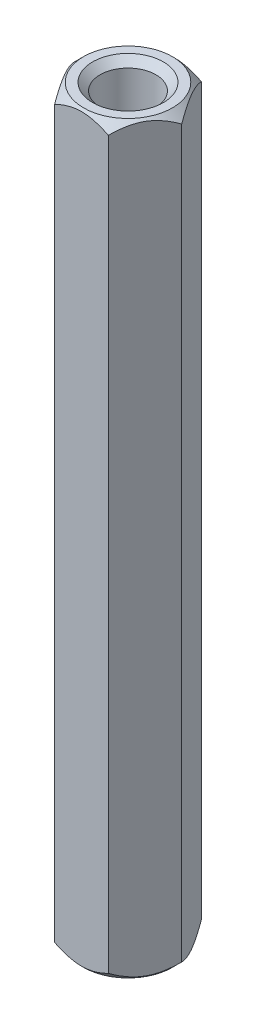
ISO-10303-21;
HEADER;
FILE_DESCRIPTION(('STEP AP214'),'2;1');
FILE_NAME('part.step','',(''),(''),'','','');
FILE_SCHEMA(('AUTOMOTIVE_DESIGN { 1 0 10303 214 1 1 1 1 }'));
ENDSEC;
DATA;
#1=APPLICATION_CONTEXT('core data for automotive mechanical design processes');
#2=APPLICATION_PROTOCOL_DEFINITION('international standard','automotive_design',2000,#1);
#3=PRODUCT_CONTEXT('',#1,'mechanical');
#4=PRODUCT('Part','Part','',(#3));
#5=PRODUCT_RELATED_PRODUCT_CATEGORY('part','',(#4));
#6=PRODUCT_DEFINITION_FORMATION('','',#4);
#7=PRODUCT_DEFINITION_CONTEXT('part definition',#1,'design');
#8=PRODUCT_DEFINITION('design','',#6,#7);
#9=PRODUCT_DEFINITION_SHAPE('','',#8);
#10=(LENGTH_UNIT() NAMED_UNIT(*) SI_UNIT(.MILLI.,.METRE.));
#11=(NAMED_UNIT(*) PLANE_ANGLE_UNIT() SI_UNIT($,.RADIAN.));
#12=(NAMED_UNIT(*) SI_UNIT($,.STERADIAN.) SOLID_ANGLE_UNIT());
#13=UNCERTAINTY_MEASURE_WITH_UNIT(LENGTH_MEASURE(1.E-05),#10,'distance_accuracy_value','');
#14=(GEOMETRIC_REPRESENTATION_CONTEXT(3) GLOBAL_UNCERTAINTY_ASSIGNED_CONTEXT((#13)) GLOBAL_UNIT_ASSIGNED_CONTEXT((#10,
#11,#12)) REPRESENTATION_CONTEXT('',''));
#15=CARTESIAN_POINT('',(0.,0.,0.));
#16=DIRECTION('',(0.,0.,1.));
#17=DIRECTION('',(1.,0.,0.));
#18=AXIS2_PLACEMENT_3D('',#15,#16,#17);
#19=CARTESIAN_POINT('',(0.,0.,0.));
#20=DIRECTION('',(0.,1.,0.));
#21=DIRECTION('',(0.,0.,1.));
#22=AXIS2_PLACEMENT_3D('',#19,#20,#21);
#23=PLANE('',#22);
#24=CARTESIAN_POINT('',(0.,0.,0.));
#25=DIRECTION('',(0.,1.,0.));
#26=DIRECTION('',(0.,0.,1.));
#27=AXIS2_PLACEMENT_3D('',#24,#25,#26);
#28=CIRCLE('',#27,2.413);
#29=CARTESIAN_POINT('',(0.,0.,2.413));
#30=VERTEX_POINT('',#29);
#31=EDGE_CURVE('E270',#30,#30,#28,.T.);
#32=ORIENTED_EDGE('',*,*,#31,.T.);
#33=EDGE_LOOP('',(#32));
#34=FACE_BOUND('',#33,.T.);
#35=CARTESIAN_POINT('',(0.,0.,0.));
#36=DIRECTION('',(0.,1.,0.));
#37=DIRECTION('',(0.,0.,1.));
#38=AXIS2_PLACEMENT_3D('',#35,#36,#37);
#39=CIRCLE('',#38,3.03117420935412);
#40=CARTESIAN_POINT('',(0.,0.,3.03117420935412));
#41=VERTEX_POINT('',#40);
#42=EDGE_CURVE('E273',#41,#41,#39,.T.);
#43=ORIENTED_EDGE('',*,*,#42,.F.);
#44=EDGE_LOOP('',(#43));
#45=FACE_BOUND('',#44,.T.);
#46=ADVANCED_FACE('F47',(#34,#45),#23,.F.);
#47=CARTESIAN_POINT('',(0.,50.8,0.));
#48=DIRECTION('',(0.,1.,0.));
#49=DIRECTION('',(0.,0.,1.));
#50=AXIS2_PLACEMENT_3D('',#47,#48,#49);
#51=PLANE('',#50);
#52=CARTESIAN_POINT('',(0.,50.8,0.));
#53=DIRECTION('',(0.,1.,0.));
#54=DIRECTION('',(0.,0.,1.));
#55=AXIS2_PLACEMENT_3D('',#52,#53,#54);
#56=CIRCLE('',#55,2.41300000000001);
#57=CARTESIAN_POINT('',(0.,50.8,2.41300000000001));
#58=VERTEX_POINT('',#57);
#59=EDGE_CURVE('E11',#58,#58,#56,.F.);
#60=ORIENTED_EDGE('',*,*,#59,.T.);
#61=EDGE_LOOP('',(#60));
#62=FACE_BOUND('',#61,.T.);
#63=CARTESIAN_POINT('',(0.,50.8,0.));
#64=DIRECTION('',(0.,1.,0.));
#65=DIRECTION('',(0.,0.,1.));
#66=AXIS2_PLACEMENT_3D('',#63,#64,#65);
#67=CIRCLE('',#66,3.03117420935412);
#68=CARTESIAN_POINT('',(0.,50.8,3.03117420935412));
#69=VERTEX_POINT('',#68);
#70=EDGE_CURVE('E276',#69,#69,#67,.T.);
#71=ORIENTED_EDGE('',*,*,#70,.T.);
#72=EDGE_LOOP('',(#71));
#73=FACE_BOUND('',#72,.T.);
#74=ADVANCED_FACE('F260',(#62,#73),#51,.T.);
#75=CARTESIAN_POINT('',(0.,50.8,0.));
#76=DIRECTION('',(0.,-1.,0.));
#77=DIRECTION('',(0.,0.,-1.));
#78=AXIS2_PLACEMENT_3D('',#75,#76,#77);
#79=CYLINDRICAL_SURFACE('',#78,1.905);
#80=CARTESIAN_POINT('',(0.,0.508000000000002,0.));
#81=DIRECTION('',(0.,1.,0.));
#82=DIRECTION('',(0.,0.,1.));
#83=AXIS2_PLACEMENT_3D('',#80,#81,#82);
#84=CIRCLE('',#83,1.905);
#85=CARTESIAN_POINT('',(0.,0.508000000000002,1.905));
#86=VERTEX_POINT('',#85);
#87=EDGE_CURVE('E57',#86,#86,#84,.F.);
#88=ORIENTED_EDGE('',*,*,#87,.T.);
#89=EDGE_LOOP('',(#88));
#90=FACE_BOUND('',#89,.T.);
#91=CARTESIAN_POINT('',(0.,50.292,0.));
#92=DIRECTION('',(0.,1.,0.));
#93=DIRECTION('',(0.,0.,1.));
#94=AXIS2_PLACEMENT_3D('',#91,#92,#93);
#95=CIRCLE('',#94,1.905);
#96=CARTESIAN_POINT('',(0.,50.292,1.905));
#97=VERTEX_POINT('',#96);
#98=EDGE_CURVE('E295',#97,#97,#95,.T.);
#99=ORIENTED_EDGE('',*,*,#98,.T.);
#100=EDGE_LOOP('',(#99));
#101=FACE_BOUND('',#100,.T.);
#102=ADVANCED_FACE('F171',(#90,#101),#79,.F.);
#103=CARTESIAN_POINT('',(0.,50.8,0.));
#104=DIRECTION('',(0.,-1.,0.));
#105=DIRECTION('',(0.,0.,-1.));
#106=AXIS2_PLACEMENT_3D('',#103,#104,#105);
#107=CONICAL_SURFACE('',#106,3.03117420935412,0.785398163397455);
#108=ORIENTED_EDGE('',*,*,#70,.F.);
#109=EDGE_LOOP('',(#108));
#110=FACE_BOUND('',#109,.T.);
#111=CARTESIAN_POINT('',(1.83297163462323,50.1648845244911,3.1752));
#112=CARTESIAN_POINT('',(1.89598269034567,50.2278410163082,3.06606165005017));
#113=CARTESIAN_POINT('',(1.9600473688431,50.2870998957653,2.95509837192205));
#114=CARTESIAN_POINT('',(2.09068223086865,50.3956013442695,2.72883215365405));
#115=CARTESIAN_POINT('',(2.15726483710766,50.4447835460613,2.61350769674773));
#116=CARTESIAN_POINT('',(2.29152545937819,50.529033541126,2.38096147751937));
#117=CARTESIAN_POINT('',(2.35916928558036,50.5643130855006,2.26379893371884));
#118=CARTESIAN_POINT('',(2.49594609220167,50.6186684298652,2.02689455535371));
#119=CARTESIAN_POINT('',(2.56507489458671,50.6377848024704,1.90715995735643));
#120=CARTESIAN_POINT('',(2.68421566990708,50.6550328693768,1.7008020812484));
#121=CARTESIAN_POINT('',(2.73407378526964,50.6575860663862,1.61444529227083));
#122=CARTESIAN_POINT('',(2.83370891608765,50.6532837268767,1.44187218347526));
#123=CARTESIAN_POINT('',(2.88348589698875,50.6464248919786,1.35565592350718));
#124=CARTESIAN_POINT('',(2.98256827629563,50.6236901166963,1.18404020841285));
#125=CARTESIAN_POINT('',(3.0318730843838,50.6078040903127,1.0986417757467));
#126=CARTESIAN_POINT('',(3.12963590884151,50.567882016002,0.9293115966945));
#127=CARTESIAN_POINT('',(3.17809398983285,50.5438465929148,0.845379738380225));
#128=CARTESIAN_POINT('',(3.26412109539651,50.4943947655828,0.696376420715858));
#129=CARTESIAN_POINT('',(3.30188053733772,50.470278280699,0.630975148808243));
#130=CARTESIAN_POINT('',(3.37672152840271,50.4181585328628,0.501346749794873));
#131=CARTESIAN_POINT('',(3.41380305681744,50.3901551513965,0.43711965855826));
#132=CARTESIAN_POINT('',(3.4871713971199,50.3308894344555,0.310041965487388));
#133=CARTESIAN_POINT('',(3.52346029578353,50.2996373466458,0.247187749251266));
#134=CARTESIAN_POINT('',(3.59536602138645,50.2342846556081,0.1226433791519));
#135=CARTESIAN_POINT('',(3.63098324454239,50.2001858004815,0.0609525390212849));
#136=CARTESIAN_POINT('',(3.66628967940796,50.1648845244911,-0.000200000000001985));
#137=B_SPLINE_CURVE_WITH_KNOTS('',3,(#111,#112,#113,#114,#115,#116,#117,#118,#119,#120,#121,
#122,#123,#124,#125,#126,#127,#128,#129,#130,#131,#132,#133,#134,#135,#136),.UNSPECIFIED.,.F.,
.F.,(4,2,2,2,2,2,2,2,2,2,2,2,4),(0.,0.422910572436811,0.848285055427816,1.26690402276128,
1.68446903107508,1.98329272958354,2.28222117546893,2.58148426995468,2.88072442418455,
3.11844134429548,3.35616551414407,3.59316134346767,3.8300126974443),.UNSPECIFIED.);
#138=CARTESIAN_POINT('',(1.83308710467706,50.165,3.175));
#139=VERTEX_POINT('',#138);
#140=CARTESIAN_POINT('',(3.66617420935412,50.165,0.));
#141=VERTEX_POINT('',#140);
#142=EDGE_CURVE('E102',#139,#141,#137,.T.);
#143=ORIENTED_EDGE('',*,*,#142,.T.);
#144=CARTESIAN_POINT('',(3.66628967940796,50.1648845244911,0.000199999999999294));
#145=CARTESIAN_POINT('',(3.60327862368552,50.2278410163082,-0.108938349949828));
#146=CARTESIAN_POINT('',(3.53921394518808,50.2870998957653,-0.219901628077947));
#147=CARTESIAN_POINT('',(3.40857908316253,50.3956013442695,-0.44616784634595));
#148=CARTESIAN_POINT('',(3.34199647692352,50.4447835460613,-0.561492303252267));
#149=CARTESIAN_POINT('',(3.207735854653,50.529033541126,-0.794038522480632));
#150=CARTESIAN_POINT('',(3.14009202845082,50.5643130855006,-0.911201066281157));
#151=CARTESIAN_POINT('',(3.00331522182951,50.6186684298652,-1.14810544464629));
#152=CARTESIAN_POINT('',(2.93418641944448,50.6377848024704,-1.26784004264356));
#153=CARTESIAN_POINT('',(2.81504564412411,50.6550328693768,-1.47419791875159));
#154=CARTESIAN_POINT('',(2.76518752876155,50.6575860663862,-1.56055470772917));
#155=CARTESIAN_POINT('',(2.66555239794354,50.6532837268767,-1.73312781652473));
#156=CARTESIAN_POINT('',(2.61577541704244,50.6464248919786,-1.81934407649282));
#157=CARTESIAN_POINT('',(2.51669303773556,50.6236901166963,-1.99095979158715));
#158=CARTESIAN_POINT('',(2.46738822964739,50.6078040903127,-2.07635822425329));
#159=CARTESIAN_POINT('',(2.36962540518967,50.567882016002,-2.2456884033055));
#160=CARTESIAN_POINT('',(2.32116732419834,50.5438465929148,-2.32962026161977));
#161=CARTESIAN_POINT('',(2.23514021863467,50.4943947655828,-2.47862357928414));
#162=CARTESIAN_POINT('',(2.19738077669347,50.470278280699,-2.54402485119175));
#163=CARTESIAN_POINT('',(2.12253978562848,50.4181585328628,-2.67365325020513));
#164=CARTESIAN_POINT('',(2.08545825721375,50.3901551513965,-2.73788034144174));
#165=CARTESIAN_POINT('',(2.01208991691129,50.3308894344555,-2.86495803451261));
#166=CARTESIAN_POINT('',(1.97580101824766,50.2996373466458,-2.92781225074873));
#167=CARTESIAN_POINT('',(1.90389529264474,50.2342846556081,-3.0523566208481));
#168=CARTESIAN_POINT('',(1.86827806948879,50.2001858004815,-3.11404746097871));
#169=CARTESIAN_POINT('',(1.83297163462322,50.1648845244911,-3.1752));
#170=B_SPLINE_CURVE_WITH_KNOTS('',3,(#144,#145,#146,#147,#148,#149,#150,#151,#152,#153,#154,
#155,#156,#157,#158,#159,#160,#161,#162,#163,#164,#165,#166,#167,#168,#169),.UNSPECIFIED.,.F.,
.F.,(4,2,2,2,2,2,2,2,2,2,2,2,4),(0.,0.42291057243681,0.848285055427814,1.26690402276128,
1.68446903107507,1.98329272958353,2.28222117546892,2.58148426995468,2.88072442418455,
3.11844134429548,3.35616551414406,3.59316134346767,3.8300126974443),.UNSPECIFIED.);
#171=CARTESIAN_POINT('',(1.83308710467706,50.165,-3.175));
#172=VERTEX_POINT('',#171);
#173=EDGE_CURVE('E120',#141,#172,#170,.T.);
#174=ORIENTED_EDGE('',*,*,#173,.T.);
#175=CARTESIAN_POINT('',(5.61290617506479,47.3825045225055,-3.175));
#176=CARTESIAN_POINT('',(5.44732323893505,47.5265718843868,-3.175));
#177=CARTESIAN_POINT('',(5.28101909971827,47.6698274026015,-3.175));
#178=CARTESIAN_POINT('',(4.94640706370483,47.9541346726965,-3.175));
#179=CARTESIAN_POINT('',(4.77809827268191,48.095185370824,-3.175));
#180=CARTESIAN_POINT('',(4.43534717886911,48.3774323105833,-3.175));
#181=CARTESIAN_POINT('',(4.26085133978467,48.5185637753496,-3.175));
#182=CARTESIAN_POINT('',(3.90862720541281,48.7966652521518,-3.175));
#183=CARTESIAN_POINT('',(3.73089972486959,48.9336362904604,-3.175));
#184=CARTESIAN_POINT('',(3.37091941799771,49.2019952183891,-3.175));
#185=CARTESIAN_POINT('',(3.18866131314985,49.3333760606888,-3.175));
#186=CARTESIAN_POINT('',(2.81821451137681,49.5879737307244,-3.175));
#187=CARTESIAN_POINT('',(2.63002118112734,49.711183935003,-3.175));
#188=CARTESIAN_POINT('',(2.34265967138502,49.8861750005027,-3.175));
#189=CARTESIAN_POINT('',(2.24637591489893,49.9426856213251,-3.175));
#190=CARTESIAN_POINT('',(2.0516194430317,50.051855803702,-3.175));
#191=CARTESIAN_POINT('',(1.95314646520395,50.1045149002493,-3.175));
#192=CARTESIAN_POINT('',(1.75391284586501,50.2049572984449,-3.175));
#193=CARTESIAN_POINT('',(1.65315588807968,50.2527478512795,-3.175));
#194=CARTESIAN_POINT('',(1.44902458223588,50.3423504891832,-3.175));
#195=CARTESIAN_POINT('',(1.34565094994104,50.3841641887937,-3.175));
#196=CARTESIAN_POINT('',(1.13381810325428,50.4612742055481,-3.175));
#197=CARTESIAN_POINT('',(1.02529677325664,50.4964022639523,-3.175));
#198=CARTESIAN_POINT('',(0.805623275609342,50.5572573121023,-3.175));
#199=CARTESIAN_POINT('',(0.69447152908934,50.5829857960223,-3.175));
#200=CARTESIAN_POINT('',(0.470887391316211,50.6233142444286,-3.175));
#201=CARTESIAN_POINT('',(0.358468357961218,50.6379867869456,-3.175));
#202=CARTESIAN_POINT('',(0.132702878699556,50.655393961851,-3.175));
#203=CARTESIAN_POINT('',(0.0193565519572753,50.6581301047463,-3.175));
#204=CARTESIAN_POINT('',(-0.207220417890732,50.6514399649393,-3.175));
#205=CARTESIAN_POINT('',(-0.320450245169739,50.6419866604378,-3.175));
#206=CARTESIAN_POINT('',(-0.545349592106199,50.6116092001877,-3.175));
#207=CARTESIAN_POINT('',(-0.657018784259608,50.5906826727426,-3.175));
#208=CARTESIAN_POINT('',(-0.878771128248322,50.5385845599097,-3.175));
#209=CARTESIAN_POINT('',(-0.988836381351385,50.5073381628379,-3.175));
#210=CARTESIAN_POINT('',(-1.20614787324581,50.4363455170065,-3.175));
#211=CARTESIAN_POINT('',(-1.31339403790103,50.3965990449632,-3.175));
#212=CARTESIAN_POINT('',(-1.54643707959043,50.3015015449478,-3.175));
#213=CARTESIAN_POINT('',(-1.67160382978464,50.2446202355638,-3.175));
#214=CARTESIAN_POINT('',(-1.91822606859857,50.1232522807231,-3.175));
#215=CARTESIAN_POINT('',(-2.03967939558908,50.0587613078601,-3.175));
#216=CARTESIAN_POINT('',(-2.27955054647384,49.9238574759861,-3.175));
#217=CARTESIAN_POINT('',(-2.39796167176233,49.8534328035283,-3.175));
#218=CARTESIAN_POINT('',(-2.63196890501255,49.7081316035234,-3.175));
#219=CARTESIAN_POINT('',(-2.74756555699748,49.6332559461148,-3.175));
#220=CARTESIAN_POINT('',(-2.97704040949025,49.4796121809063,-3.175));
#221=CARTESIAN_POINT('',(-3.09090589461549,49.4008251698366,-3.175));
#222=CARTESIAN_POINT('',(-3.31666410566459,49.2404671404988,-3.175));
#223=CARTESIAN_POINT('',(-3.42855668167324,49.1588959120376,-3.175));
#224=CARTESIAN_POINT('',(-3.76149892463042,48.9110698440516,-3.175));
#225=CARTESIAN_POINT('',(-3.98008836672613,48.74151424494,-3.175));
#226=CARTESIAN_POINT('',(-4.43857055661304,48.3758785774618,-3.175));
#227=CARTESIAN_POINT('',(-4.67786798975818,48.1790590041652,-3.175));
#228=CARTESIAN_POINT('',(-5.03232612724527,47.8813056165569,-3.175));
#229=CARTESIAN_POINT('',(-5.14905444076479,47.7822262163152,-3.175));
#230=CARTESIAN_POINT('',(-5.38161209807003,47.5830722412516,-3.175));
#231=CARTESIAN_POINT('',(-5.49744164585887,47.48299790477,-3.175));
#232=CARTESIAN_POINT('',(-5.61290617506479,47.3825045225055,-3.175));
#233=B_SPLINE_CURVE_WITH_KNOTS('',3,(#175,#176,#177,#178,#179,#180,#181,#182,#183,#184,#185,
#186,#187,#188,#189,#190,#191,#192,#193,#194,#195,#196,#197,#198,#199,#200,#201,#202,#203,#204,
#205,#206,#207,#208,#209,#210,#211,#212,#213,#214,#215,#216,#217,#218,#219,#220,#221,#222,#223,
#224,#225,#226,#227,#228,#229,#230,#231,#232),.UNSPECIFIED.,.F.,.F.,(4,2,2,2,2,2,2,2,2,2,2,2,2,
2,2,2,2,2,2,2,2,2,2,2,2,2,2,2,4),(0.,0.658465440924479,1.31723651212542,1.99046902096711,
2.66353408887634,3.33742393680572,4.0118535534173,4.34671274542173,4.68161229957307,
5.01600553029358,5.35030825919232,5.69215068400589,6.03393874523514,6.37346306796546,
6.71294442391085,7.05317964400231,7.39348522262328,7.73631400153946,8.0791517871342,
8.49126076517264,8.9036052380698,9.31679098002148,9.72989621083109,10.1452412451898,
10.5606177054787,11.3903708195066,12.3198013539585,12.7791226544808,13.2383364543487),.UNSPECIFIED.);
#234=CARTESIAN_POINT('',(-1.83308710467706,50.165,-3.175));
#235=VERTEX_POINT('',#234);
#236=EDGE_CURVE('E194',#172,#235,#233,.T.);
#237=ORIENTED_EDGE('',*,*,#236,.T.);
#238=CARTESIAN_POINT('',(-1.83297163462322,50.1648845244911,-3.1752));
#239=CARTESIAN_POINT('',(-1.89598269034567,50.2278410163082,-3.06606165005017));
#240=CARTESIAN_POINT('',(-1.9600473688431,50.2870998957653,-2.95509837192205));
#241=CARTESIAN_POINT('',(-2.09068223086865,50.3956013442695,-2.72883215365405));
#242=CARTESIAN_POINT('',(-2.15726483710766,50.4447835460613,-2.61350769674773));
#243=CARTESIAN_POINT('',(-2.29152545937819,50.529033541126,-2.38096147751937));
#244=CARTESIAN_POINT('',(-2.35916928558036,50.5643130855006,-2.26379893371885));
#245=CARTESIAN_POINT('',(-2.49594609220167,50.6186684298652,-2.02689455535371));
#246=CARTESIAN_POINT('',(-2.56507489458671,50.6377848024704,-1.90715995735644));
#247=CARTESIAN_POINT('',(-2.68421566990708,50.6550328693768,-1.70080208124841));
#248=CARTESIAN_POINT('',(-2.73407378526963,50.6575860663862,-1.61444529227083));
#249=CARTESIAN_POINT('',(-2.83370891608764,50.6532837268767,-1.44187218347527));
#250=CARTESIAN_POINT('',(-2.88348589698874,50.6464248919786,-1.35565592350718));
#251=CARTESIAN_POINT('',(-2.98256827629562,50.6236901166963,-1.18404020841285));
#252=CARTESIAN_POINT('',(-3.03187308438379,50.6078040903127,-1.09864177574671));
#253=CARTESIAN_POINT('',(-3.12963590884151,50.567882016002,-0.929311596694504));
#254=CARTESIAN_POINT('',(-3.17809398983284,50.5438465929148,-0.845379738380229));
#255=CARTESIAN_POINT('',(-3.26412109539651,50.4943947655828,-0.696376420715863));
#256=CARTESIAN_POINT('',(-3.30188053733772,50.470278280699,-0.630975148808249));
#257=CARTESIAN_POINT('',(-3.37672152840271,50.4181585328628,-0.501346749794878));
#258=CARTESIAN_POINT('',(-3.41380305681743,50.3901551513965,-0.437119658558264));
#259=CARTESIAN_POINT('',(-3.4871713971199,50.3308894344555,-0.310041965487391));
#260=CARTESIAN_POINT('',(-3.52346029578353,50.2996373466458,-0.247187749251268));
#261=CARTESIAN_POINT('',(-3.59536602138645,50.2342846556081,-0.122643379151903));
#262=CARTESIAN_POINT('',(-3.63098324454239,50.2001858004815,-0.0609525390212875));
#263=CARTESIAN_POINT('',(-3.66628967940796,50.1648845244911,0.00020000000000061));
#264=B_SPLINE_CURVE_WITH_KNOTS('',3,(#238,#239,#240,#241,#242,#243,#244,#245,#246,#247,#248,
#249,#250,#251,#252,#253,#254,#255,#256,#257,#258,#259,#260,#261,#262,#263),.UNSPECIFIED.,.F.,
.F.,(4,2,2,2,2,2,2,2,2,2,2,2,4),(0.,0.42291057243681,0.848285055427813,1.26690402276128,
1.68446903107507,1.98329272958353,2.28222117546892,2.58148426995468,2.88072442418454,
3.11844134429548,3.35616551414406,3.59316134346767,3.8300126974443),.UNSPECIFIED.);
#265=CARTESIAN_POINT('',(-3.66617420935412,50.165,0.));
#266=VERTEX_POINT('',#265);
#267=EDGE_CURVE('E187',#235,#266,#264,.T.);
#268=ORIENTED_EDGE('',*,*,#267,.T.);
#269=CARTESIAN_POINT('',(-3.66628967940796,50.1648845244911,-0.000199999999999957));
#270=CARTESIAN_POINT('',(-3.60327862368552,50.2278410163082,0.108938349949828));
#271=CARTESIAN_POINT('',(-3.53921394518808,50.2870998957653,0.219901628077948));
#272=CARTESIAN_POINT('',(-3.40857908316253,50.3956013442695,0.446167846345952));
#273=CARTESIAN_POINT('',(-3.34199647692352,50.4447835460613,0.56149230325227));
#274=CARTESIAN_POINT('',(-3.207735854653,50.529033541126,0.794038522480636));
#275=CARTESIAN_POINT('',(-3.14009202845082,50.5643130855006,0.911201066281161));
#276=CARTESIAN_POINT('',(-3.00331522182951,50.6186684298652,1.14810544464629));
#277=CARTESIAN_POINT('',(-2.93418641944447,50.6377848024704,1.26784004264357));
#278=CARTESIAN_POINT('',(-2.8150456441241,50.6550328693768,1.47419791875159));
#279=CARTESIAN_POINT('',(-2.76518752876155,50.6575860663862,1.56055470772917));
#280=CARTESIAN_POINT('',(-2.66555239794354,50.6532837268767,1.73312781652473));
#281=CARTESIAN_POINT('',(-2.61577541704244,50.6464248919786,1.81934407649282));
#282=CARTESIAN_POINT('',(-2.51669303773556,50.6236901166963,1.99095979158715));
#283=CARTESIAN_POINT('',(-2.46738822964739,50.6078040903127,2.0763582242533));
#284=CARTESIAN_POINT('',(-2.36962540518967,50.567882016002,2.2456884033055));
#285=CARTESIAN_POINT('',(-2.32116732419834,50.5438465929148,2.32962026161977));
#286=CARTESIAN_POINT('',(-2.23514021863467,50.4943947655828,2.47862357928414));
#287=CARTESIAN_POINT('',(-2.19738077669347,50.470278280699,2.54402485119176));
#288=CARTESIAN_POINT('',(-2.12253978562848,50.4181585328628,2.67365325020513));
#289=CARTESIAN_POINT('',(-2.08545825721375,50.3901551513965,2.73788034144174));
#290=CARTESIAN_POINT('',(-2.01208991691129,50.3308894344555,2.86495803451261));
#291=CARTESIAN_POINT('',(-1.97580101824766,50.2996373466458,2.92781225074873));
#292=CARTESIAN_POINT('',(-1.90389529264474,50.2342846556081,3.0523566208481));
#293=CARTESIAN_POINT('',(-1.86827806948879,50.2001858004815,3.11404746097871));
#294=CARTESIAN_POINT('',(-1.83297163462322,50.1648845244911,3.1752));
#295=B_SPLINE_CURVE_WITH_KNOTS('',3,(#269,#270,#271,#272,#273,#274,#275,#276,#277,#278,#279,
#280,#281,#282,#283,#284,#285,#286,#287,#288,#289,#290,#291,#292,#293,#294),.UNSPECIFIED.,.F.,
.F.,(4,2,2,2,2,2,2,2,2,2,2,2,4),(0.,0.422910572436812,0.848285055427819,1.26690402276129,
1.68446903107508,1.98329272958353,2.28222117546892,2.58148426995468,2.88072442418455,
3.11844134429549,3.35616551414407,3.59316134346768,3.83001269744429),.UNSPECIFIED.);
#296=CARTESIAN_POINT('',(-1.83308710467706,50.165,3.175));
#297=VERTEX_POINT('',#296);
#298=EDGE_CURVE('E64',#266,#297,#295,.T.);
#299=ORIENTED_EDGE('',*,*,#298,.T.);
#300=CARTESIAN_POINT('',(-5.61290617506479,47.3825045225055,3.175));
#301=CARTESIAN_POINT('',(-5.44732323893506,47.5265718843868,3.175));
#302=CARTESIAN_POINT('',(-5.28101909971828,47.6698274026015,3.175));
#303=CARTESIAN_POINT('',(-4.94640706370483,47.9541346726965,3.175));
#304=CARTESIAN_POINT('',(-4.77809827268192,48.095185370824,3.175));
#305=CARTESIAN_POINT('',(-4.43534717886911,48.3774323105833,3.175));
#306=CARTESIAN_POINT('',(-4.26085133978467,48.5185637753496,3.175));
#307=CARTESIAN_POINT('',(-3.90862720541282,48.7966652521518,3.175));
#308=CARTESIAN_POINT('',(-3.7308997248696,48.9336362904604,3.175));
#309=CARTESIAN_POINT('',(-3.37091941799772,49.2019952183891,3.175));
#310=CARTESIAN_POINT('',(-3.18866131314986,49.3333760606887,3.175));
#311=CARTESIAN_POINT('',(-2.81821451137682,49.5879737307244,3.175));
#312=CARTESIAN_POINT('',(-2.63002118112734,49.711183935003,3.175));
#313=CARTESIAN_POINT('',(-2.34265967138502,49.8861750005027,3.175));
#314=CARTESIAN_POINT('',(-2.24637591489894,49.9426856213251,3.175));
#315=CARTESIAN_POINT('',(-2.0516194430317,50.051855803702,3.175));
#316=CARTESIAN_POINT('',(-1.95314646520395,50.1045149002493,3.175));
#317=CARTESIAN_POINT('',(-1.75391284586501,50.2049572984449,3.175));
#318=CARTESIAN_POINT('',(-1.65315588807968,50.2527478512795,3.175));
#319=CARTESIAN_POINT('',(-1.44902458223588,50.3423504891832,3.175));
#320=CARTESIAN_POINT('',(-1.34565094994104,50.3841641887937,3.175));
#321=CARTESIAN_POINT('',(-1.13381810325428,50.4612742055481,3.175));
#322=CARTESIAN_POINT('',(-1.02529677325665,50.4964022639523,3.175));
#323=CARTESIAN_POINT('',(-0.805623275609343,50.5572573121023,3.175));
#324=CARTESIAN_POINT('',(-0.694471529089342,50.5829857960223,3.175));
#325=CARTESIAN_POINT('',(-0.470887391316213,50.6233142444286,3.175));
#326=CARTESIAN_POINT('',(-0.358468357961219,50.6379867869456,3.175));
#327=CARTESIAN_POINT('',(-0.132702878699557,50.655393961851,3.175));
#328=CARTESIAN_POINT('',(-0.0193565519572758,50.6581301047463,3.175));
#329=CARTESIAN_POINT('',(0.207220417890732,50.6514399649393,3.175));
#330=CARTESIAN_POINT('',(0.320450245169739,50.6419866604378,3.175));
#331=CARTESIAN_POINT('',(0.5453495921062,50.6116092001877,3.175));
#332=CARTESIAN_POINT('',(0.657018784259609,50.5906826727426,3.175));
#333=CARTESIAN_POINT('',(0.878771128248323,50.5385845599097,3.175));
#334=CARTESIAN_POINT('',(0.988836381351386,50.5073381628379,3.175));
#335=CARTESIAN_POINT('',(1.20614787324581,50.4363455170065,3.175));
#336=CARTESIAN_POINT('',(1.31339403790103,50.3965990449632,3.175));
#337=CARTESIAN_POINT('',(1.54643707959043,50.3015015449478,3.175));
#338=CARTESIAN_POINT('',(1.67160382978464,50.2446202355638,3.175));
#339=CARTESIAN_POINT('',(1.91822606859857,50.1232522807231,3.175));
#340=CARTESIAN_POINT('',(2.03967939558908,50.0587613078601,3.175));
#341=CARTESIAN_POINT('',(2.27955054647384,49.9238574759861,3.175));
#342=CARTESIAN_POINT('',(2.39796167176234,49.8534328035283,3.175));
#343=CARTESIAN_POINT('',(2.63196890501255,49.7081316035234,3.175));
#344=CARTESIAN_POINT('',(2.74756555699748,49.6332559461148,3.175));
#345=CARTESIAN_POINT('',(2.97704040949025,49.4796121809063,3.175));
#346=CARTESIAN_POINT('',(3.09090589461549,49.4008251698366,3.175));
#347=CARTESIAN_POINT('',(3.31666410566459,49.2404671404988,3.175));
#348=CARTESIAN_POINT('',(3.42855668167325,49.1588959120376,3.175));
#349=CARTESIAN_POINT('',(3.76149892463043,48.9110698440515,3.175));
#350=CARTESIAN_POINT('',(3.98008836672614,48.74151424494,3.175));
#351=CARTESIAN_POINT('',(4.43857055661305,48.3758785774618,3.175));
#352=CARTESIAN_POINT('',(4.67786798975818,48.1790590041652,3.175));
#353=CARTESIAN_POINT('',(5.03232612724527,47.8813056165569,3.175));
#354=CARTESIAN_POINT('',(5.1490544407648,47.7822262163152,3.175));
#355=CARTESIAN_POINT('',(5.38161209807003,47.5830722412516,3.175));
#356=CARTESIAN_POINT('',(5.49744164585888,47.48299790477,3.175));
#357=CARTESIAN_POINT('',(5.61290617506479,47.3825045225055,3.175));
#358=B_SPLINE_CURVE_WITH_KNOTS('',3,(#300,#301,#302,#303,#304,#305,#306,#307,#308,#309,#310,
#311,#312,#313,#314,#315,#316,#317,#318,#319,#320,#321,#322,#323,#324,#325,#326,#327,#328,#329,
#330,#331,#332,#333,#334,#335,#336,#337,#338,#339,#340,#341,#342,#343,#344,#345,#346,#347,#348,
#349,#350,#351,#352,#353,#354,#355,#356,#357),.UNSPECIFIED.,.F.,.F.,(4,2,2,2,2,2,2,2,2,2,2,2,2,
2,2,2,2,2,2,2,2,2,2,2,2,2,2,2,4),(0.,0.658465440924487,1.31723651212543,1.99046902096711,
2.66353408887634,3.33742393680572,4.0118535534173,4.34671274542174,4.68161229957307,
5.01600553029359,5.35030825919232,5.69215068400589,6.03393874523515,6.37346306796547,
6.71294442391086,7.05317964400232,7.39348522262329,7.73631400153947,8.07915178713421,
8.49126076517265,8.90360523806981,9.31679098002149,9.7298962108311,10.1452412451898,
10.5606177054787,11.3903708195066,12.3198013539585,12.7791226544808,13.2383364543487),.UNSPECIFIED.);
#359=EDGE_CURVE('E99',#297,#139,#358,.T.);
#360=ORIENTED_EDGE('',*,*,#359,.T.);
#361=EDGE_LOOP('',(#143,#174,#237,#268,#299,#360));
#362=FACE_BOUND('',#361,.T.);
#363=ADVANCED_FACE('F101',(#110,#362),#107,.T.);
#364=CARTESIAN_POINT('',(0.,0.,0.));
#365=DIRECTION('',(0.,1.,0.));
#366=DIRECTION('',(0.,0.,1.));
#367=AXIS2_PLACEMENT_3D('',#364,#365,#366);
#368=CONICAL_SURFACE('',#367,3.03117420935412,0.785398163397455);
#369=ORIENTED_EDGE('',*,*,#42,.T.);
#370=EDGE_LOOP('',(#369));
#371=FACE_BOUND('',#370,.T.);
#372=CARTESIAN_POINT('',(-5.61290617506479,3.41749547749447,3.175));
#373=CARTESIAN_POINT('',(-5.44732323893506,3.2734281156132,3.175));
#374=CARTESIAN_POINT('',(-5.28101909971828,3.13017259739852,3.175));
#375=CARTESIAN_POINT('',(-4.94640706370483,2.84586532730345,3.175));
#376=CARTESIAN_POINT('',(-4.77809827268192,2.70481462917605,3.175));
#377=CARTESIAN_POINT('',(-4.43534717886912,2.42256768941669,3.175));
#378=CARTESIAN_POINT('',(-4.26085133978467,2.28143622465037,3.175));
#379=CARTESIAN_POINT('',(-3.90862720541282,2.00333474784817,3.175));
#380=CARTESIAN_POINT('',(-3.7308997248696,1.86636370953955,3.175));
#381=CARTESIAN_POINT('',(-3.37091941799772,1.59800478161092,3.175));
#382=CARTESIAN_POINT('',(-3.18866131314985,1.46662393931124,3.175));
#383=CARTESIAN_POINT('',(-2.81821451137682,1.21202626927557,3.175));
#384=CARTESIAN_POINT('',(-2.63002118112734,1.08881606499699,3.175));
#385=CARTESIAN_POINT('',(-2.34265967138502,0.91382499949728,3.175));
#386=CARTESIAN_POINT('',(-2.24637591489894,0.857314378674902,3.175));
#387=CARTESIAN_POINT('',(-2.0516194430317,0.748144196298006,3.175));
#388=CARTESIAN_POINT('',(-1.95314646520395,0.69548509975072,3.175));
#389=CARTESIAN_POINT('',(-1.75391284586501,0.595042701555058,3.175));
#390=CARTESIAN_POINT('',(-1.65315588807968,0.547252148720535,3.175));
#391=CARTESIAN_POINT('',(-1.44902458223588,0.457649510816776,3.175));
#392=CARTESIAN_POINT('',(-1.34565094994104,0.415835811206337,3.175));
#393=CARTESIAN_POINT('',(-1.13381810325428,0.338725794451859,3.175));
#394=CARTESIAN_POINT('',(-1.02529677325665,0.303597736047739,3.175));
#395=CARTESIAN_POINT('',(-0.805623275609342,0.242742687897681,3.175));
#396=CARTESIAN_POINT('',(-0.694471529089341,0.217014203977667,3.175));
#397=CARTESIAN_POINT('',(-0.470887391316213,0.176685755571393,3.175));
#398=CARTESIAN_POINT('',(-0.358468357961219,0.162013213054357,3.175));
#399=CARTESIAN_POINT('',(-0.132702878699557,0.144606038148979,3.175));
#400=CARTESIAN_POINT('',(-0.0193565519572763,0.141869895253728,3.175));
#401=CARTESIAN_POINT('',(0.207220417890732,0.148560035060717,3.175));
#402=CARTESIAN_POINT('',(0.320450245169739,0.158013339562199,3.175));
#403=CARTESIAN_POINT('',(0.545349592106199,0.188390799812307,3.175));
#404=CARTESIAN_POINT('',(0.657018784259609,0.209317327257442,3.175));
#405=CARTESIAN_POINT('',(0.878771128248323,0.261415440090346,3.175));
#406=CARTESIAN_POINT('',(0.988836381351385,0.292661837162134,3.175));
#407=CARTESIAN_POINT('',(1.20614787324581,0.363654482993548,3.175));
#408=CARTESIAN_POINT('',(1.31339403790103,0.403400955036758,3.175));
#409=CARTESIAN_POINT('',(1.54643707959043,0.498498455052226,3.175));
#410=CARTESIAN_POINT('',(1.67160382978464,0.55537976443618,3.175));
#411=CARTESIAN_POINT('',(1.91822606859857,0.676747719276859,3.175));
#412=CARTESIAN_POINT('',(2.03967939558908,0.74123869213987,3.175));
#413=CARTESIAN_POINT('',(2.27955054647384,0.876142524013884,3.175));
#414=CARTESIAN_POINT('',(2.39796167176234,0.94656719647173,3.175));
#415=CARTESIAN_POINT('',(2.63196890501255,1.09186839647657,3.175));
#416=CARTESIAN_POINT('',(2.74756555699748,1.16674405388522,3.175));
#417=CARTESIAN_POINT('',(2.97704040949025,1.32038781909372,3.175));
#418=CARTESIAN_POINT('',(3.09090589461549,1.39917483016341,3.175));
#419=CARTESIAN_POINT('',(3.31666410566459,1.55953285950118,3.175));
#420=CARTESIAN_POINT('',(3.42855668167325,1.64110408796239,3.175));
#421=CARTESIAN_POINT('',(3.76149892463043,1.88893015594845,3.175));
#422=CARTESIAN_POINT('',(3.98008836672614,2.05848575505995,3.175));
#423=CARTESIAN_POINT('',(4.43857055661305,2.42412142253815,3.175));
#424=CARTESIAN_POINT('',(4.67786798975818,2.62094099583476,3.175));
#425=CARTESIAN_POINT('',(5.03232612724527,2.91869438344306,3.175));
#426=CARTESIAN_POINT('',(5.1490544407648,3.01777378368479,3.175));
#427=CARTESIAN_POINT('',(5.38161209807003,3.21692775874835,3.175));
#428=CARTESIAN_POINT('',(5.49744164585888,3.31700209522998,3.175));
#429=CARTESIAN_POINT('',(5.61290617506479,3.41749547749447,3.175));
#430=B_SPLINE_CURVE_WITH_KNOTS('',3,(#372,#373,#374,#375,#376,#377,#378,#379,#380,#381,#382,
#383,#384,#385,#386,#387,#388,#389,#390,#391,#392,#393,#394,#395,#396,#397,#398,#399,#400,#401,
#402,#403,#404,#405,#406,#407,#408,#409,#410,#411,#412,#413,#414,#415,#416,#417,#418,#419,#420,
#421,#422,#423,#424,#425,#426,#427,#428,#429),.UNSPECIFIED.,.F.,.F.,(4,2,2,2,2,2,2,2,2,2,2,2,2,
2,2,2,2,2,2,2,2,2,2,2,2,2,2,2,4),(0.,0.658465440924485,1.31723651212543,1.99046902096711,
2.66353408887634,3.33742393680573,4.01185355341731,4.34671274542173,4.68161229957307,
5.01600553029358,5.35030825919232,5.69215068400589,6.03393874523515,6.37346306796547,
6.71294442391086,7.05317964400232,7.39348522262329,7.73631400153947,8.07915178713421,
8.49126076517265,8.90360523806981,9.31679098002149,9.7298962108311,10.1452412451899,
10.5606177054787,11.3903708195066,12.3198013539585,12.7791226544808,13.2383364543487),.UNSPECIFIED.);
#431=CARTESIAN_POINT('',(-1.83308710467706,0.634999999999991,3.175));
#432=VERTEX_POINT('',#431);
#433=CARTESIAN_POINT('',(1.83308710467706,0.634999999999991,3.175));
#434=VERTEX_POINT('',#433);
#435=EDGE_CURVE('E109',#432,#434,#430,.T.);
#436=ORIENTED_EDGE('',*,*,#435,.F.);
#437=CARTESIAN_POINT('',(-3.66628967940796,0.635115475508935,-0.000199999999999824));
#438=CARTESIAN_POINT('',(-3.60327862368552,0.572158983691774,0.108938349949827));
#439=CARTESIAN_POINT('',(-3.53921394518808,0.512900104234736,0.219901628077947));
#440=CARTESIAN_POINT('',(-3.40857908316253,0.404398655730548,0.44616784634595));
#441=CARTESIAN_POINT('',(-3.34199647692352,0.355216453938704,0.561492303252267));
#442=CARTESIAN_POINT('',(-3.207735854653,0.270966458873997,0.794038522480631));
#443=CARTESIAN_POINT('',(-3.14009202845082,0.235686914499443,0.911201066281156));
#444=CARTESIAN_POINT('',(-3.00331522182951,0.181331570134815,1.14810544464629));
#445=CARTESIAN_POINT('',(-2.93418641944448,0.162215197529635,1.26784004264356));
#446=CARTESIAN_POINT('',(-2.81504564412411,0.144967130623244,1.47419791875159));
#447=CARTESIAN_POINT('',(-2.76518752876155,0.142413933613817,1.56055470772917));
#448=CARTESIAN_POINT('',(-2.66555239794354,0.146716273123262,1.73312781652473));
#449=CARTESIAN_POINT('',(-2.61577541704244,0.153575108021442,1.81934407649282));
#450=CARTESIAN_POINT('',(-2.51669303773556,0.176309883303699,1.99095979158715));
#451=CARTESIAN_POINT('',(-2.46738822964739,0.192195909687277,2.07635822425329));
#452=CARTESIAN_POINT('',(-2.36962540518968,0.232117983997953,2.24568840330549));
#453=CARTESIAN_POINT('',(-2.32116732419834,0.256153407085172,2.32962026161977));
#454=CARTESIAN_POINT('',(-2.23514021863468,0.305605234417167,2.47862357928414));
#455=CARTESIAN_POINT('',(-2.19738077669347,0.329721719300989,2.54402485119175));
#456=CARTESIAN_POINT('',(-2.12253978562848,0.381841467137155,2.67365325020512));
#457=CARTESIAN_POINT('',(-2.08545825721375,0.409844848603525,2.73788034144174));
#458=CARTESIAN_POINT('',(-2.01208991691129,0.469110565544507,2.86495803451261));
#459=CARTESIAN_POINT('',(-1.97580101824766,0.500362653354205,2.92781225074873));
#460=CARTESIAN_POINT('',(-1.90389529264474,0.565715344391926,3.0523566208481));
#461=CARTESIAN_POINT('',(-1.86827806948879,0.599814199518537,3.11404746097871));
#462=CARTESIAN_POINT('',(-1.83297163462322,0.635115475508935,3.1752));
#463=B_SPLINE_CURVE_WITH_KNOTS('',3,(#437,#438,#439,#440,#441,#442,#443,#444,#445,#446,#447,
#448,#449,#450,#451,#452,#453,#454,#455,#456,#457,#458,#459,#460,#461,#462),.UNSPECIFIED.,.F.,
.F.,(4,2,2,2,2,2,2,2,2,2,2,2,4),(0.,0.422910572436811,0.848285055427812,1.26690402276128,
1.68446903107507,1.98329272958353,2.28222117546892,2.58148426995468,2.88072442418454,
3.11844134429548,3.35616551414406,3.59316134346767,3.83001269744429),.UNSPECIFIED.);
#464=CARTESIAN_POINT('',(-3.66617420935412,0.634999999999991,0.));
#465=VERTEX_POINT('',#464);
#466=EDGE_CURVE('E119',#465,#432,#463,.T.);
#467=ORIENTED_EDGE('',*,*,#466,.F.);
#468=CARTESIAN_POINT('',(-1.83297163462322,0.635115475508935,-3.1752));
#469=CARTESIAN_POINT('',(-1.89598269034567,0.572158983691774,-3.06606165005017));
#470=CARTESIAN_POINT('',(-1.9600473688431,0.512900104234736,-2.95509837192205));
#471=CARTESIAN_POINT('',(-2.09068223086865,0.404398655730548,-2.72883215365405));
#472=CARTESIAN_POINT('',(-2.15726483710766,0.355216453938704,-2.61350769674773));
#473=CARTESIAN_POINT('',(-2.29152545937819,0.270966458873996,-2.38096147751937));
#474=CARTESIAN_POINT('',(-2.35916928558036,0.235686914499443,-2.26379893371884));
#475=CARTESIAN_POINT('',(-2.49594609220167,0.181331570134814,-2.02689455535371));
#476=CARTESIAN_POINT('',(-2.56507489458671,0.162215197529634,-1.90715995735644));
#477=CARTESIAN_POINT('',(-2.68421566990708,0.144967130623244,-1.70080208124841));
#478=CARTESIAN_POINT('',(-2.73407378526963,0.142413933613817,-1.61444529227083));
#479=CARTESIAN_POINT('',(-2.83370891608764,0.146716273123262,-1.44187218347527));
#480=CARTESIAN_POINT('',(-2.88348589698874,0.153575108021442,-1.35565592350718));
#481=CARTESIAN_POINT('',(-2.98256827629562,0.176309883303699,-1.18404020841285));
#482=CARTESIAN_POINT('',(-3.03187308438379,0.192195909687278,-1.09864177574671));
#483=CARTESIAN_POINT('',(-3.12963590884151,0.232117983997953,-0.929311596694505));
#484=CARTESIAN_POINT('',(-3.17809398983284,0.256153407085172,-0.845379738380229));
#485=CARTESIAN_POINT('',(-3.26412109539651,0.305605234417168,-0.696376420715863));
#486=CARTESIAN_POINT('',(-3.30188053733772,0.32972171930099,-0.630975148808248));
#487=CARTESIAN_POINT('',(-3.37672152840271,0.381841467137156,-0.501346749794877));
#488=CARTESIAN_POINT('',(-3.41380305681743,0.409844848603525,-0.437119658558263));
#489=CARTESIAN_POINT('',(-3.4871713971199,0.469110565544507,-0.31004196548739));
#490=CARTESIAN_POINT('',(-3.52346029578353,0.500362653354205,-0.247187749251268));
#491=CARTESIAN_POINT('',(-3.59536602138645,0.565715344391927,-0.122643379151903));
#492=CARTESIAN_POINT('',(-3.63098324454239,0.599814199518538,-0.0609525390212883));
#493=CARTESIAN_POINT('',(-3.66628967940796,0.635115475508935,0.000200000000000179));
#494=B_SPLINE_CURVE_WITH_KNOTS('',3,(#468,#469,#470,#471,#472,#473,#474,#475,#476,#477,#478,
#479,#480,#481,#482,#483,#484,#485,#486,#487,#488,#489,#490,#491,#492,#493),.UNSPECIFIED.,.F.,
.F.,(4,2,2,2,2,2,2,2,2,2,2,2,4),(0.,0.422910572436811,0.848285055427814,1.26690402276128,
1.68446903107507,1.98329272958353,2.28222117546892,2.58148426995468,2.88072442418454,
3.11844134429548,3.35616551414406,3.59316134346767,3.83001269744429),.UNSPECIFIED.);
#495=CARTESIAN_POINT('',(-1.83308710467706,0.634999999999991,-3.175));
#496=VERTEX_POINT('',#495);
#497=EDGE_CURVE('E235',#496,#465,#494,.T.);
#498=ORIENTED_EDGE('',*,*,#497,.F.);
#499=CARTESIAN_POINT('',(5.61290617506479,3.41749547749446,-3.175));
#500=CARTESIAN_POINT('',(5.44732323893505,3.27342811561319,-3.175));
#501=CARTESIAN_POINT('',(5.28101909971827,3.13017259739852,-3.175));
#502=CARTESIAN_POINT('',(4.94640706370483,2.84586532730345,-3.175));
#503=CARTESIAN_POINT('',(4.77809827268191,2.70481462917604,-3.175));
#504=CARTESIAN_POINT('',(4.43534717886911,2.42256768941669,-3.175));
#505=CARTESIAN_POINT('',(4.26085133978467,2.28143622465037,-3.175));
#506=CARTESIAN_POINT('',(3.90862720541281,2.00333474784817,-3.175));
#507=CARTESIAN_POINT('',(3.73089972486959,1.86636370953955,-3.175));
#508=CARTESIAN_POINT('',(3.37091941799771,1.59800478161091,-3.175));
#509=CARTESIAN_POINT('',(3.18866131314985,1.46662393931124,-3.175));
#510=CARTESIAN_POINT('',(2.81821451137681,1.21202626927557,-3.175));
#511=CARTESIAN_POINT('',(2.63002118112734,1.08881606499699,-3.175));
#512=CARTESIAN_POINT('',(2.34265967138501,0.913824999497278,-3.175));
#513=CARTESIAN_POINT('',(2.24637591489893,0.8573143786749,-3.175));
#514=CARTESIAN_POINT('',(2.0516194430317,0.748144196298004,-3.175));
#515=CARTESIAN_POINT('',(1.95314646520394,0.695485099750718,-3.175));
#516=CARTESIAN_POINT('',(1.75391284586501,0.595042701555056,-3.175));
#517=CARTESIAN_POINT('',(1.65315588807968,0.547252148720533,-3.175));
#518=CARTESIAN_POINT('',(1.44902458223587,0.457649510816775,-3.175));
#519=CARTESIAN_POINT('',(1.34565094994104,0.415835811206335,-3.175));
#520=CARTESIAN_POINT('',(1.13381810325428,0.338725794451858,-3.175));
#521=CARTESIAN_POINT('',(1.02529677325664,0.303597736047738,-3.175));
#522=CARTESIAN_POINT('',(0.805623275609338,0.242742687897681,-3.175));
#523=CARTESIAN_POINT('',(0.694471529089338,0.217014203977667,-3.175));
#524=CARTESIAN_POINT('',(0.470887391316209,0.176685755571393,-3.175));
#525=CARTESIAN_POINT('',(0.358468357961216,0.162013213054357,-3.175));
#526=CARTESIAN_POINT('',(0.132702878699554,0.14460603814898,-3.175));
#527=CARTESIAN_POINT('',(0.0193565519572731,0.141869895253728,-3.175));
#528=CARTESIAN_POINT('',(-0.207220417890734,0.148560035060717,-3.175));
#529=CARTESIAN_POINT('',(-0.320450245169741,0.158013339562199,-3.175));
#530=CARTESIAN_POINT('',(-0.545349592106201,0.188390799812308,-3.175));
#531=CARTESIAN_POINT('',(-0.65701878425961,0.209317327257443,-3.175));
#532=CARTESIAN_POINT('',(-0.878771128248325,0.261415440090347,-3.175));
#533=CARTESIAN_POINT('',(-0.988836381351387,0.292661837162135,-3.175));
#534=CARTESIAN_POINT('',(-1.20614787324581,0.363654482993549,-3.175));
#535=CARTESIAN_POINT('',(-1.31339403790103,0.403400955036759,-3.175));
#536=CARTESIAN_POINT('',(-1.54643707959043,0.498498455052227,-3.175));
#537=CARTESIAN_POINT('',(-1.67160382978464,0.555379764436181,-3.175));
#538=CARTESIAN_POINT('',(-1.91822606859858,0.676747719276861,-3.175));
#539=CARTESIAN_POINT('',(-2.03967939558909,0.741238692139872,-3.175));
#540=CARTESIAN_POINT('',(-2.27955054647385,0.876142524013886,-3.175));
#541=CARTESIAN_POINT('',(-2.39796167176234,0.946567196471732,-3.175));
#542=CARTESIAN_POINT('',(-2.63196890501256,1.09186839647657,-3.175));
#543=CARTESIAN_POINT('',(-2.74756555699748,1.16674405388522,-3.175));
#544=CARTESIAN_POINT('',(-2.97704040949026,1.32038781909372,-3.175));
#545=CARTESIAN_POINT('',(-3.0909058946155,1.39917483016342,-3.175));
#546=CARTESIAN_POINT('',(-3.3166641056646,1.55953285950118,-3.175));
#547=CARTESIAN_POINT('',(-3.42855668167325,1.6411040879624,-3.175));
#548=CARTESIAN_POINT('',(-3.76149892463043,1.88893015594845,-3.175));
#549=CARTESIAN_POINT('',(-3.98008836672614,2.05848575505996,-3.175));
#550=CARTESIAN_POINT('',(-4.43857055661305,2.42412142253816,-3.175));
#551=CARTESIAN_POINT('',(-4.67786798975818,2.62094099583477,-3.175));
#552=CARTESIAN_POINT('',(-5.03232612724528,2.91869438344307,-3.175));
#553=CARTESIAN_POINT('',(-5.1490544407648,3.0177737836848,-3.175));
#554=CARTESIAN_POINT('',(-5.38161209807003,3.21692775874835,-3.175));
#555=CARTESIAN_POINT('',(-5.49744164585888,3.31700209522998,-3.175));
#556=CARTESIAN_POINT('',(-5.61290617506479,3.41749547749446,-3.175));
#557=B_SPLINE_CURVE_WITH_KNOTS('',3,(#499,#500,#501,#502,#503,#504,#505,#506,#507,#508,#509,
#510,#511,#512,#513,#514,#515,#516,#517,#518,#519,#520,#521,#522,#523,#524,#525,#526,#527,#528,
#529,#530,#531,#532,#533,#534,#535,#536,#537,#538,#539,#540,#541,#542,#543,#544,#545,#546,#547,
#548,#549,#550,#551,#552,#553,#554,#555,#556),.UNSPECIFIED.,.F.,.F.,(4,2,2,2,2,2,2,2,2,2,2,2,2,
2,2,2,2,2,2,2,2,2,2,2,2,2,2,2,4),(0.,0.658465440924485,1.31723651212543,1.99046902096711,
2.66353408887634,3.33742393680572,4.0118535534173,4.34671274542173,4.68161229957307,
5.01600553029358,5.35030825919232,5.69215068400589,6.03393874523515,6.37346306796547,
6.71294442391086,7.05317964400231,7.39348522262329,7.73631400153946,8.07915178713421,
8.49126076517265,8.9036052380698,9.31679098002149,9.7298962108311,10.1452412451899,
10.5606177054787,11.3903708195066,12.3198013539585,12.7791226544808,13.2383364543487),.UNSPECIFIED.);
#558=CARTESIAN_POINT('',(1.83308710467706,0.63499999999999,-3.175));
#559=VERTEX_POINT('',#558);
#560=EDGE_CURVE('E227',#559,#496,#557,.T.);
#561=ORIENTED_EDGE('',*,*,#560,.F.);
#562=CARTESIAN_POINT('',(3.66628967940796,0.635115475508935,0.000199999999999162));
#563=CARTESIAN_POINT('',(3.60327862368552,0.572158983691774,-0.108938349949828));
#564=CARTESIAN_POINT('',(3.53921394518808,0.512900104234736,-0.219901628077948));
#565=CARTESIAN_POINT('',(3.40857908316253,0.404398655730548,-0.446167846345952));
#566=CARTESIAN_POINT('',(3.34199647692352,0.355216453938704,-0.561492303252269));
#567=CARTESIAN_POINT('',(3.207735854653,0.270966458873996,-0.794038522480633));
#568=CARTESIAN_POINT('',(3.14009202845082,0.235686914499442,-0.911201066281158));
#569=CARTESIAN_POINT('',(3.00331522182951,0.181331570134814,-1.14810544464629));
#570=CARTESIAN_POINT('',(2.93418641944448,0.162215197529634,-1.26784004264356));
#571=CARTESIAN_POINT('',(2.81504564412411,0.144967130623244,-1.47419791875159));
#572=CARTESIAN_POINT('',(2.76518752876155,0.142413933613817,-1.56055470772917));
#573=CARTESIAN_POINT('',(2.66555239794354,0.146716273123262,-1.73312781652473));
#574=CARTESIAN_POINT('',(2.61577541704244,0.153575108021442,-1.81934407649282));
#575=CARTESIAN_POINT('',(2.51669303773556,0.176309883303699,-1.99095979158715));
#576=CARTESIAN_POINT('',(2.46738822964739,0.192195909687277,-2.07635822425329));
#577=CARTESIAN_POINT('',(2.36962540518967,0.232117983997953,-2.2456884033055));
#578=CARTESIAN_POINT('',(2.32116732419834,0.256153407085172,-2.32962026161977));
#579=CARTESIAN_POINT('',(2.23514021863467,0.305605234417168,-2.47862357928414));
#580=CARTESIAN_POINT('',(2.19738077669347,0.329721719300989,-2.54402485119175));
#581=CARTESIAN_POINT('',(2.12253978562848,0.381841467137155,-2.67365325020512));
#582=CARTESIAN_POINT('',(2.08545825721375,0.409844848603525,-2.73788034144174));
#583=CARTESIAN_POINT('',(2.01208991691129,0.469110565544507,-2.86495803451261));
#584=CARTESIAN_POINT('',(1.97580101824766,0.500362653354205,-2.92781225074873));
#585=CARTESIAN_POINT('',(1.90389529264474,0.565715344391926,-3.0523566208481));
#586=CARTESIAN_POINT('',(1.86827806948879,0.599814199518537,-3.11404746097871));
#587=CARTESIAN_POINT('',(1.83297163462322,0.635115475508935,-3.1752));
#588=B_SPLINE_CURVE_WITH_KNOTS('',3,(#562,#563,#564,#565,#566,#567,#568,#569,#570,#571,#572,
#573,#574,#575,#576,#577,#578,#579,#580,#581,#582,#583,#584,#585,#586,#587),.UNSPECIFIED.,.F.,
.F.,(4,2,2,2,2,2,2,2,2,2,2,2,4),(0.,0.422910572436812,0.848285055427815,1.26690402276128,
1.68446903107507,1.98329272958353,2.28222117546892,2.58148426995468,2.88072442418454,
3.11844134429548,3.35616551414406,3.59316134346767,3.83001269744429),.UNSPECIFIED.);
#589=CARTESIAN_POINT('',(3.66617420935412,0.634999999999991,0.));
#590=VERTEX_POINT('',#589);
#591=EDGE_CURVE('E130',#590,#559,#588,.T.);
#592=ORIENTED_EDGE('',*,*,#591,.F.);
#593=CARTESIAN_POINT('',(1.83297163462323,0.635115475508936,3.1752));
#594=CARTESIAN_POINT('',(1.89598269034567,0.572158983691775,3.06606165005017));
#595=CARTESIAN_POINT('',(1.9600473688431,0.512900104234737,2.95509837192205));
#596=CARTESIAN_POINT('',(2.09068223086865,0.404398655730549,2.72883215365405));
#597=CARTESIAN_POINT('',(2.15726483710766,0.355216453938705,2.61350769674773));
#598=CARTESIAN_POINT('',(2.29152545937819,0.270966458873997,2.38096147751937));
#599=CARTESIAN_POINT('',(2.35916928558036,0.235686914499443,2.26379893371884));
#600=CARTESIAN_POINT('',(2.49594609220167,0.181331570134815,2.02689455535371));
#601=CARTESIAN_POINT('',(2.56507489458671,0.162215197529635,1.90715995735644));
#602=CARTESIAN_POINT('',(2.68421566990708,0.144967130623244,1.70080208124841));
#603=CARTESIAN_POINT('',(2.73407378526963,0.142413933613817,1.61444529227083));
#604=CARTESIAN_POINT('',(2.83370891608764,0.146716273123262,1.44187218347527));
#605=CARTESIAN_POINT('',(2.88348589698874,0.153575108021442,1.35565592350718));
#606=CARTESIAN_POINT('',(2.98256827629562,0.176309883303699,1.18404020841286));
#607=CARTESIAN_POINT('',(3.03187308438379,0.192195909687277,1.09864177574671));
#608=CARTESIAN_POINT('',(3.12963590884151,0.232117983997952,0.929311596694508));
#609=CARTESIAN_POINT('',(3.17809398983284,0.256153407085171,0.845379738380232));
#610=CARTESIAN_POINT('',(3.26412109539651,0.305605234417167,0.696376420715865));
#611=CARTESIAN_POINT('',(3.30188053733772,0.329721719300989,0.63097514880825));
#612=CARTESIAN_POINT('',(3.37672152840271,0.381841467137155,0.501346749794878));
#613=CARTESIAN_POINT('',(3.41380305681743,0.409844848603525,0.437119658558263));
#614=CARTESIAN_POINT('',(3.4871713971199,0.469110565544507,0.31004196548739));
#615=CARTESIAN_POINT('',(3.52346029578353,0.500362653354205,0.247187749251268));
#616=CARTESIAN_POINT('',(3.59536602138645,0.565715344391927,0.122643379151903));
#617=CARTESIAN_POINT('',(3.63098324454239,0.599814199518538,0.060952539021288));
#618=CARTESIAN_POINT('',(3.66628967940796,0.635115475508935,-0.000200000000000917));
#619=B_SPLINE_CURVE_WITH_KNOTS('',3,(#593,#594,#595,#596,#597,#598,#599,#600,#601,#602,#603,
#604,#605,#606,#607,#608,#609,#610,#611,#612,#613,#614,#615,#616,#617,#618),.UNSPECIFIED.,.F.,
.F.,(4,2,2,2,2,2,2,2,2,2,2,2,4),(0.,0.42291057243681,0.848285055427812,1.26690402276128,
1.68446903107507,1.98329272958353,2.28222117546892,2.58148426995467,2.88072442418454,
3.11844134429548,3.35616551414406,3.59316134346767,3.83001269744429),.UNSPECIFIED.);
#620=EDGE_CURVE('E72',#434,#590,#619,.T.);
#621=ORIENTED_EDGE('',*,*,#620,.F.);
#622=EDGE_LOOP('',(#436,#467,#498,#561,#592,#621));
#623=FACE_BOUND('',#622,.T.);
#624=ADVANCED_FACE('F170',(#371,#623),#368,.T.);
#625=CARTESIAN_POINT('',(-1.83308710467706,50.8,3.175));
#626=DIRECTION('',(0.,0.,-1.));
#627=DIRECTION('',(-1.,0.,0.));
#628=AXIS2_PLACEMENT_3D('',#625,#626,#627);
#629=PLANE('',#628);
#630=DIRECTION('',(0.,-1.,0.));
#631=VECTOR('',#630,1.);
#632=CARTESIAN_POINT('',(-1.83308710467706,50.8,3.175));
#633=LINE('',#632,#631);
#634=EDGE_CURVE('E124',#297,#432,#633,.T.);
#635=ORIENTED_EDGE('',*,*,#634,.T.);
#636=ORIENTED_EDGE('',*,*,#435,.T.);
#637=DIRECTION('',(0.,-1.,0.));
#638=VECTOR('',#637,1.);
#639=CARTESIAN_POINT('',(1.83308710467706,50.8,3.175));
#640=LINE('',#639,#638);
#641=EDGE_CURVE('E116',#139,#434,#640,.T.);
#642=ORIENTED_EDGE('',*,*,#641,.F.);
#643=ORIENTED_EDGE('',*,*,#359,.F.);
#644=EDGE_LOOP('',(#635,#636,#642,#643));
#645=FACE_BOUND('',#644,.T.);
#646=ADVANCED_FACE('F122',(#645),#629,.F.);
#647=CARTESIAN_POINT('',(-3.66617420935412,50.8,0.));
#648=DIRECTION('',(0.866025403784439,0.,-0.5));
#649=DIRECTION('',(-0.5,0.,-0.866025403784439));
#650=AXIS2_PLACEMENT_3D('',#647,#648,#649);
#651=PLANE('',#650);
#652=DIRECTION('',(0.,-1.,0.));
#653=VECTOR('',#652,1.);
#654=CARTESIAN_POINT('',(-3.66617420935412,50.8,0.));
#655=LINE('',#654,#653);
#656=EDGE_CURVE('E128',#266,#465,#655,.T.);
#657=ORIENTED_EDGE('',*,*,#656,.T.);
#658=ORIENTED_EDGE('',*,*,#466,.T.);
#659=ORIENTED_EDGE('',*,*,#634,.F.);
#660=ORIENTED_EDGE('',*,*,#298,.F.);
#661=EDGE_LOOP('',(#657,#658,#659,#660));
#662=FACE_BOUND('',#661,.T.);
#663=ADVANCED_FACE('F249',(#662),#651,.F.);
#664=CARTESIAN_POINT('',(-1.83308710467706,50.8,-3.175));
#665=DIRECTION('',(0.866025403784439,0.,0.5));
#666=DIRECTION('',(0.5,0.,-0.866025403784439));
#667=AXIS2_PLACEMENT_3D('',#664,#665,#666);
#668=PLANE('',#667);
#669=DIRECTION('',(0.,-1.,0.));
#670=VECTOR('',#669,1.);
#671=CARTESIAN_POINT('',(-1.83308710467706,50.8,-3.175));
#672=LINE('',#671,#670);
#673=EDGE_CURVE('E143',#235,#496,#672,.T.);
#674=ORIENTED_EDGE('',*,*,#673,.T.);
#675=ORIENTED_EDGE('',*,*,#497,.T.);
#676=ORIENTED_EDGE('',*,*,#656,.F.);
#677=ORIENTED_EDGE('',*,*,#267,.F.);
#678=EDGE_LOOP('',(#674,#675,#676,#677));
#679=FACE_BOUND('',#678,.T.);
#680=ADVANCED_FACE('F246',(#679),#668,.F.);
#681=CARTESIAN_POINT('',(1.83308710467706,50.8,-3.175));
#682=DIRECTION('',(0.,0.,1.));
#683=DIRECTION('',(1.,0.,0.));
#684=AXIS2_PLACEMENT_3D('',#681,#682,#683);
#685=PLANE('',#684);
#686=DIRECTION('',(0.,-1.,0.));
#687=VECTOR('',#686,1.);
#688=CARTESIAN_POINT('',(1.83308710467706,50.8,-3.175));
#689=LINE('',#688,#687);
#690=EDGE_CURVE('E147',#172,#559,#689,.T.);
#691=ORIENTED_EDGE('',*,*,#690,.T.);
#692=ORIENTED_EDGE('',*,*,#560,.T.);
#693=ORIENTED_EDGE('',*,*,#673,.F.);
#694=ORIENTED_EDGE('',*,*,#236,.F.);
#695=EDGE_LOOP('',(#691,#692,#693,#694));
#696=FACE_BOUND('',#695,.T.);
#697=ADVANCED_FACE('F215',(#696),#685,.F.);
#698=CARTESIAN_POINT('',(3.66617420935412,50.8,0.));
#699=DIRECTION('',(-0.866025403784438,0.,0.5));
#700=DIRECTION('',(0.5,0.,0.866025403784439));
#701=AXIS2_PLACEMENT_3D('',#698,#699,#700);
#702=PLANE('',#701);
#703=DIRECTION('',(0.,-1.,0.));
#704=VECTOR('',#703,1.);
#705=CARTESIAN_POINT('',(3.66617420935412,50.8,0.));
#706=LINE('',#705,#704);
#707=EDGE_CURVE('E110',#141,#590,#706,.T.);
#708=ORIENTED_EDGE('',*,*,#707,.T.);
#709=ORIENTED_EDGE('',*,*,#591,.T.);
#710=ORIENTED_EDGE('',*,*,#690,.F.);
#711=ORIENTED_EDGE('',*,*,#173,.F.);
#712=EDGE_LOOP('',(#708,#709,#710,#711));
#713=FACE_BOUND('',#712,.T.);
#714=ADVANCED_FACE('F212',(#713),#702,.F.);
#715=CARTESIAN_POINT('',(1.83308710467706,50.8,3.175));
#716=DIRECTION('',(-0.866025403784439,0.,-0.5));
#717=DIRECTION('',(-0.5,0.,0.866025403784439));
#718=AXIS2_PLACEMENT_3D('',#715,#716,#717);
#719=PLANE('',#718);
#720=ORIENTED_EDGE('',*,*,#641,.T.);
#721=ORIENTED_EDGE('',*,*,#620,.T.);
#722=ORIENTED_EDGE('',*,*,#707,.F.);
#723=ORIENTED_EDGE('',*,*,#142,.F.);
#724=EDGE_LOOP('',(#720,#721,#722,#723));
#725=FACE_BOUND('',#724,.T.);
#726=ADVANCED_FACE('F115',(#725),#719,.F.);
#727=CARTESIAN_POINT('',(0.,0.,0.));
#728=DIRECTION('',(0.,-1.,0.));
#729=DIRECTION('',(0.,0.,-1.));
#730=AXIS2_PLACEMENT_3D('',#727,#728,#729);
#731=CONICAL_SURFACE('',#730,2.413,0.785398163397446);
#732=ORIENTED_EDGE('',*,*,#87,.F.);
#733=EDGE_LOOP('',(#732));
#734=FACE_BOUND('',#733,.T.);
#735=ORIENTED_EDGE('',*,*,#31,.F.);
#736=EDGE_LOOP('',(#735));
#737=FACE_BOUND('',#736,.T.);
#738=ADVANCED_FACE('F305',(#734,#737),#731,.F.);
#739=CARTESIAN_POINT('',(0.,50.292,0.));
#740=DIRECTION('',(0.,1.,0.));
#741=DIRECTION('',(0.,0.,1.));
#742=AXIS2_PLACEMENT_3D('',#739,#740,#741);
#743=CONICAL_SURFACE('',#742,1.905,0.785398163397439);
#744=ORIENTED_EDGE('',*,*,#59,.F.);
#745=EDGE_LOOP('',(#744));
#746=FACE_BOUND('',#745,.T.);
#747=ORIENTED_EDGE('',*,*,#98,.F.);
#748=EDGE_LOOP('',(#747));
#749=FACE_BOUND('',#748,.T.);
#750=ADVANCED_FACE('F50',(#746,#749),#743,.F.);
#751=CLOSED_SHELL('',(#46,#74,#102,#363,#624,#646,#663,#680,#697,#714,#726,#738,#750));
#752=MANIFOLD_SOLID_BREP('B2',#751);
#753=ADVANCED_BREP_SHAPE_REPRESENTATION('',(#18,#752),#14);
#754=SHAPE_DEFINITION_REPRESENTATION(#9,#753);
ENDSEC;
END-ISO-10303-21;
